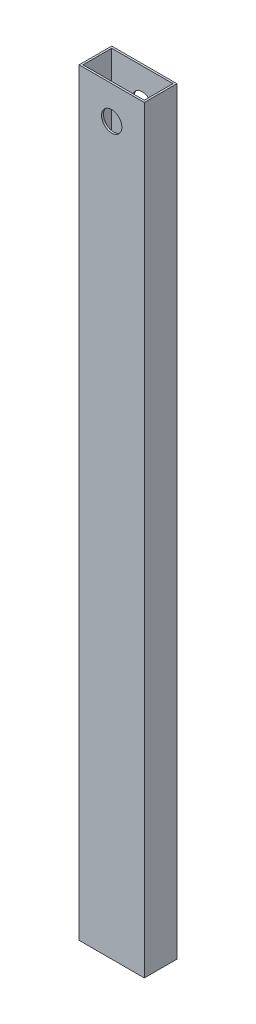
ISO-10303-21;
HEADER;
FILE_DESCRIPTION(('STEP AP214'),'2;1');
FILE_NAME('part.step','',(''),(''),'','','');
FILE_SCHEMA(('AUTOMOTIVE_DESIGN { 1 0 10303 214 1 1 1 1 }'));
ENDSEC;
DATA;
#1=APPLICATION_CONTEXT('core data for automotive mechanical design processes');
#2=APPLICATION_PROTOCOL_DEFINITION('international standard','automotive_design',2000,#1);
#3=PRODUCT_CONTEXT('',#1,'mechanical');
#4=PRODUCT('Part','Part','',(#3));
#5=PRODUCT_RELATED_PRODUCT_CATEGORY('part','',(#4));
#6=PRODUCT_DEFINITION_FORMATION('','',#4);
#7=PRODUCT_DEFINITION_CONTEXT('part definition',#1,'design');
#8=PRODUCT_DEFINITION('design','',#6,#7);
#9=PRODUCT_DEFINITION_SHAPE('','',#8);
#10=(LENGTH_UNIT() NAMED_UNIT(*) SI_UNIT(.MILLI.,.METRE.));
#11=(NAMED_UNIT(*) PLANE_ANGLE_UNIT() SI_UNIT($,.RADIAN.));
#12=(NAMED_UNIT(*) SI_UNIT($,.STERADIAN.) SOLID_ANGLE_UNIT());
#13=UNCERTAINTY_MEASURE_WITH_UNIT(LENGTH_MEASURE(1.E-05),#10,'distance_accuracy_value','');
#14=(GEOMETRIC_REPRESENTATION_CONTEXT(3) GLOBAL_UNCERTAINTY_ASSIGNED_CONTEXT((#13)) GLOBAL_UNIT_ASSIGNED_CONTEXT((#10,
#11,#12)) REPRESENTATION_CONTEXT('',''));
#15=CARTESIAN_POINT('',(0.,0.,0.));
#16=DIRECTION('',(0.,0.,1.));
#17=DIRECTION('',(1.,0.,0.));
#18=AXIS2_PLACEMENT_3D('',#15,#16,#17);
#19=CARTESIAN_POINT('',(0.,590.55,0.));
#20=DIRECTION('',(0.,1.,0.));
#21=DIRECTION('',(0.,0.,1.));
#22=AXIS2_PLACEMENT_3D('',#19,#20,#21);
#23=PLANE('',#22);
#24=DIRECTION('',(0.,0.,1.));
#25=VECTOR('',#24,1.);
#26=CARTESIAN_POINT('',(-26.2964705882353,590.55,-4.03411764705882));
#27=LINE('',#26,#25);
#28=CARTESIAN_POINT('',(-26.2964705882353,590.55,-4.03411764705882));
#29=VERTEX_POINT('',#28);
#30=CARTESIAN_POINT('',(-26.2964705882353,590.55,21.3658823529412));
#31=VERTEX_POINT('',#30);
#32=EDGE_CURVE('E156',#29,#31,#27,.T.);
#33=ORIENTED_EDGE('',*,*,#32,.T.);
#34=DIRECTION('',(1.,0.,0.));
#35=VECTOR('',#34,1.);
#36=CARTESIAN_POINT('',(-26.2964705882353,590.55,21.3658823529412));
#37=LINE('',#36,#35);
#38=CARTESIAN_POINT('',(24.5035294117647,590.55,21.3658823529412));
#39=VERTEX_POINT('',#38);
#40=EDGE_CURVE('E160',#31,#39,#37,.T.);
#41=ORIENTED_EDGE('',*,*,#40,.T.);
#42=DIRECTION('',(0.,0.,-1.));
#43=VECTOR('',#42,1.);
#44=CARTESIAN_POINT('',(24.5035294117647,590.55,-4.03411764705882));
#45=LINE('',#44,#43);
#46=CARTESIAN_POINT('',(24.5035294117647,590.55,-4.03411764705882));
#47=VERTEX_POINT('',#46);
#48=EDGE_CURVE('E164',#39,#47,#45,.T.);
#49=ORIENTED_EDGE('',*,*,#48,.T.);
#50=DIRECTION('',(-1.,0.,0.));
#51=VECTOR('',#50,1.);
#52=CARTESIAN_POINT('',(-26.2964705882353,590.55,-4.03411764705882));
#53=LINE('',#52,#51);
#54=EDGE_CURVE('E167',#47,#29,#53,.T.);
#55=ORIENTED_EDGE('',*,*,#54,.T.);
#56=EDGE_LOOP('',(#33,#41,#49,#55));
#57=FACE_BOUND('',#56,.T.);
#58=DIRECTION('',(1.,0.,0.));
#59=VECTOR('',#58,1.);
#60=CARTESIAN_POINT('',(-24.7724705882353,590.55,19.8418823529412));
#61=LINE('',#60,#59);
#62=CARTESIAN_POINT('',(-24.7724705882353,590.55,19.8418823529412));
#63=VERTEX_POINT('',#62);
#64=CARTESIAN_POINT('',(22.9795294117647,590.55,19.8418823529412));
#65=VERTEX_POINT('',#64);
#66=EDGE_CURVE('E115',#63,#65,#61,.T.);
#67=ORIENTED_EDGE('',*,*,#66,.F.);
#68=DIRECTION('',(0.,0.,1.));
#69=VECTOR('',#68,1.);
#70=CARTESIAN_POINT('',(-24.7724705882353,590.55,-2.51011764705882));
#71=LINE('',#70,#69);
#72=CARTESIAN_POINT('',(-24.7724705882353,590.55,-2.51011764705882));
#73=VERTEX_POINT('',#72);
#74=EDGE_CURVE('E106',#73,#63,#71,.T.);
#75=ORIENTED_EDGE('',*,*,#74,.F.);
#76=DIRECTION('',(-1.,0.,0.));
#77=VECTOR('',#76,1.);
#78=CARTESIAN_POINT('',(-24.7724705882353,590.55,-2.51011764705882));
#79=LINE('',#78,#77);
#80=CARTESIAN_POINT('',(22.9795294117647,590.55,-2.51011764705882));
#81=VERTEX_POINT('',#80);
#82=EDGE_CURVE('E132',#81,#73,#79,.T.);
#83=ORIENTED_EDGE('',*,*,#82,.F.);
#84=DIRECTION('',(0.,0.,-1.));
#85=VECTOR('',#84,1.);
#86=CARTESIAN_POINT('',(22.9795294117647,590.55,-2.51011764705882));
#87=LINE('',#86,#85);
#88=EDGE_CURVE('E128',#65,#81,#87,.T.);
#89=ORIENTED_EDGE('',*,*,#88,.F.);
#90=EDGE_LOOP('',(#67,#75,#83,#89));
#91=FACE_BOUND('',#90,.T.);
#92=ADVANCED_FACE('F39',(#57,#91),#23,.T.);
#93=CARTESIAN_POINT('',(0.,0.,0.));
#94=DIRECTION('',(0.,1.,0.));
#95=DIRECTION('',(0.,0.,1.));
#96=AXIS2_PLACEMENT_3D('',#93,#94,#95);
#97=PLANE('',#96);
#98=DIRECTION('',(0.,0.,1.));
#99=VECTOR('',#98,1.);
#100=CARTESIAN_POINT('',(-26.2964705882353,0.,-4.03411764705882));
#101=LINE('',#100,#99);
#102=CARTESIAN_POINT('',(-26.2964705882353,0.,-4.03411764705882));
#103=VERTEX_POINT('',#102);
#104=CARTESIAN_POINT('',(-26.2964705882353,0.,21.3658823529412));
#105=VERTEX_POINT('',#104);
#106=EDGE_CURVE('E124',#103,#105,#101,.T.);
#107=ORIENTED_EDGE('',*,*,#106,.F.);
#108=DIRECTION('',(-1.,0.,0.));
#109=VECTOR('',#108,1.);
#110=CARTESIAN_POINT('',(-26.2964705882353,0.,-4.03411764705882));
#111=LINE('',#110,#109);
#112=CARTESIAN_POINT('',(24.5035294117647,0.,-4.03411764705882));
#113=VERTEX_POINT('',#112);
#114=EDGE_CURVE('E161',#113,#103,#111,.T.);
#115=ORIENTED_EDGE('',*,*,#114,.F.);
#116=DIRECTION('',(0.,0.,-1.));
#117=VECTOR('',#116,1.);
#118=CARTESIAN_POINT('',(24.5035294117647,0.,-4.03411764705882));
#119=LINE('',#118,#117);
#120=CARTESIAN_POINT('',(24.5035294117647,0.,21.3658823529412));
#121=VERTEX_POINT('',#120);
#122=EDGE_CURVE('E177',#121,#113,#119,.T.);
#123=ORIENTED_EDGE('',*,*,#122,.F.);
#124=DIRECTION('',(1.,0.,0.));
#125=VECTOR('',#124,1.);
#126=CARTESIAN_POINT('',(-26.2964705882353,0.,21.3658823529412));
#127=LINE('',#126,#125);
#128=EDGE_CURVE('E174',#105,#121,#127,.T.);
#129=ORIENTED_EDGE('',*,*,#128,.F.);
#130=EDGE_LOOP('',(#107,#115,#123,#129));
#131=FACE_BOUND('',#130,.T.);
#132=DIRECTION('',(0.,0.,1.));
#133=VECTOR('',#132,1.);
#134=CARTESIAN_POINT('',(-24.7724705882353,0.,-2.51011764705882));
#135=LINE('',#134,#133);
#136=CARTESIAN_POINT('',(-24.7724705882353,0.,-2.51011764705882));
#137=VERTEX_POINT('',#136);
#138=CARTESIAN_POINT('',(-24.7724705882353,0.,19.8418823529412));
#139=VERTEX_POINT('',#138);
#140=EDGE_CURVE('E64',#137,#139,#135,.T.);
#141=ORIENTED_EDGE('',*,*,#140,.T.);
#142=DIRECTION('',(1.,0.,0.));
#143=VECTOR('',#142,1.);
#144=CARTESIAN_POINT('',(-24.7724705882353,0.,19.8418823529412));
#145=LINE('',#144,#143);
#146=CARTESIAN_POINT('',(22.9795294117647,0.,19.8418823529412));
#147=VERTEX_POINT('',#146);
#148=EDGE_CURVE('E122',#139,#147,#145,.T.);
#149=ORIENTED_EDGE('',*,*,#148,.T.);
#150=DIRECTION('',(0.,0.,-1.));
#151=VECTOR('',#150,1.);
#152=CARTESIAN_POINT('',(22.9795294117647,0.,-2.51011764705882));
#153=LINE('',#152,#151);
#154=CARTESIAN_POINT('',(22.9795294117647,0.,-2.51011764705882));
#155=VERTEX_POINT('',#154);
#156=EDGE_CURVE('E143',#147,#155,#153,.T.);
#157=ORIENTED_EDGE('',*,*,#156,.T.);
#158=DIRECTION('',(-1.,0.,0.));
#159=VECTOR('',#158,1.);
#160=CARTESIAN_POINT('',(-24.7724705882353,0.,-2.51011764705882));
#161=LINE('',#160,#159);
#162=EDGE_CURVE('E116',#155,#137,#161,.T.);
#163=ORIENTED_EDGE('',*,*,#162,.T.);
#164=EDGE_LOOP('',(#141,#149,#157,#163));
#165=FACE_BOUND('',#164,.T.);
#166=ADVANCED_FACE('F201',(#131,#165),#97,.F.);
#167=CARTESIAN_POINT('',(-26.2964705882353,590.55,-4.03411764705882));
#168=DIRECTION('',(1.,0.,0.));
#169=DIRECTION('',(0.,0.,-1.));
#170=AXIS2_PLACEMENT_3D('',#167,#168,#169);
#171=PLANE('',#170);
#172=ORIENTED_EDGE('',*,*,#106,.T.);
#173=DIRECTION('',(0.,-1.,0.));
#174=VECTOR('',#173,1.);
#175=CARTESIAN_POINT('',(-26.2964705882353,590.55,21.3658823529412));
#176=LINE('',#175,#174);
#177=EDGE_CURVE('E11',#31,#105,#176,.T.);
#178=ORIENTED_EDGE('',*,*,#177,.F.);
#179=ORIENTED_EDGE('',*,*,#32,.F.);
#180=DIRECTION('',(0.,-1.,0.));
#181=VECTOR('',#180,1.);
#182=CARTESIAN_POINT('',(-26.2964705882353,590.55,-4.03411764705882));
#183=LINE('',#182,#181);
#184=EDGE_CURVE('E170',#29,#103,#183,.T.);
#185=ORIENTED_EDGE('',*,*,#184,.T.);
#186=EDGE_LOOP('',(#172,#178,#179,#185));
#187=FACE_BOUND('',#186,.T.);
#188=ADVANCED_FACE('F41',(#187),#171,.F.);
#189=CARTESIAN_POINT('',(-26.2964705882353,590.55,21.3658823529412));
#190=DIRECTION('',(0.,0.,-1.));
#191=DIRECTION('',(-1.,0.,0.));
#192=AXIS2_PLACEMENT_3D('',#189,#190,#191);
#193=PLANE('',#192);
#194=CARTESIAN_POINT('',(-0.89647058823529,565.15,21.3658823529412));
#195=DIRECTION('',(0.,0.,1.));
#196=DIRECTION('',(1.,0.,0.));
#197=AXIS2_PLACEMENT_3D('',#194,#195,#196);
#198=CIRCLE('',#197,7.93750000000004);
#199=CARTESIAN_POINT('',(7.04102941176475,565.15,21.3658823529412));
#200=VERTEX_POINT('',#199);
#201=EDGE_CURVE('E239',#200,#200,#198,.T.);
#202=ORIENTED_EDGE('',*,*,#201,.F.);
#203=EDGE_LOOP('',(#202));
#204=FACE_BOUND('',#203,.T.);
#205=ORIENTED_EDGE('',*,*,#128,.T.);
#206=DIRECTION('',(0.,-1.,0.));
#207=VECTOR('',#206,1.);
#208=CARTESIAN_POINT('',(24.5035294117647,590.55,21.3658823529412));
#209=LINE('',#208,#207);
#210=EDGE_CURVE('E49',#39,#121,#209,.T.);
#211=ORIENTED_EDGE('',*,*,#210,.F.);
#212=ORIENTED_EDGE('',*,*,#40,.F.);
#213=ORIENTED_EDGE('',*,*,#177,.T.);
#214=EDGE_LOOP('',(#205,#211,#212,#213));
#215=FACE_BOUND('',#214,.T.);
#216=ADVANCED_FACE('F211',(#204,#215),#193,.F.);
#217=CARTESIAN_POINT('',(24.5035294117647,590.55,-4.03411764705882));
#218=DIRECTION('',(-1.,0.,0.));
#219=DIRECTION('',(0.,0.,1.));
#220=AXIS2_PLACEMENT_3D('',#217,#218,#219);
#221=PLANE('',#220);
#222=ORIENTED_EDGE('',*,*,#122,.T.);
#223=DIRECTION('',(0.,-1.,0.));
#224=VECTOR('',#223,1.);
#225=CARTESIAN_POINT('',(24.5035294117647,590.55,-4.03411764705882));
#226=LINE('',#225,#224);
#227=EDGE_CURVE('E185',#47,#113,#226,.T.);
#228=ORIENTED_EDGE('',*,*,#227,.F.);
#229=ORIENTED_EDGE('',*,*,#48,.F.);
#230=ORIENTED_EDGE('',*,*,#210,.T.);
#231=EDGE_LOOP('',(#222,#228,#229,#230));
#232=FACE_BOUND('',#231,.T.);
#233=ADVANCED_FACE('F195',(#232),#221,.F.);
#234=CARTESIAN_POINT('',(-26.2964705882353,590.55,-4.03411764705882));
#235=DIRECTION('',(0.,0.,1.));
#236=DIRECTION('',(1.,0.,0.));
#237=AXIS2_PLACEMENT_3D('',#234,#235,#236);
#238=PLANE('',#237);
#239=CARTESIAN_POINT('',(-0.89647058823529,565.15,-4.03411764705882));
#240=DIRECTION('',(0.,0.,1.));
#241=DIRECTION('',(1.,0.,0.));
#242=AXIS2_PLACEMENT_3D('',#239,#240,#241);
#243=CIRCLE('',#242,7.93750000000004);
#244=CARTESIAN_POINT('',(7.04102941176475,565.15,-4.03411764705882));
#245=VERTEX_POINT('',#244);
#246=EDGE_CURVE('E236',#245,#245,#243,.T.);
#247=ORIENTED_EDGE('',*,*,#246,.T.);
#248=EDGE_LOOP('',(#247));
#249=FACE_BOUND('',#248,.T.);
#250=ORIENTED_EDGE('',*,*,#114,.T.);
#251=ORIENTED_EDGE('',*,*,#184,.F.);
#252=ORIENTED_EDGE('',*,*,#54,.F.);
#253=ORIENTED_EDGE('',*,*,#227,.T.);
#254=EDGE_LOOP('',(#250,#251,#252,#253));
#255=FACE_BOUND('',#254,.T.);
#256=ADVANCED_FACE('F205',(#249,#255),#238,.F.);
#257=CARTESIAN_POINT('',(-24.7724705882353,590.55,-2.51011764705882));
#258=DIRECTION('',(1.,0.,0.));
#259=DIRECTION('',(0.,0.,-1.));
#260=AXIS2_PLACEMENT_3D('',#257,#258,#259);
#261=PLANE('',#260);
#262=ORIENTED_EDGE('',*,*,#140,.F.);
#263=DIRECTION('',(0.,-1.,0.));
#264=VECTOR('',#263,1.);
#265=CARTESIAN_POINT('',(-24.7724705882353,590.55,-2.51011764705882));
#266=LINE('',#265,#264);
#267=EDGE_CURVE('E110',#73,#137,#266,.T.);
#268=ORIENTED_EDGE('',*,*,#267,.F.);
#269=ORIENTED_EDGE('',*,*,#74,.T.);
#270=DIRECTION('',(0.,-1.,0.));
#271=VECTOR('',#270,1.);
#272=CARTESIAN_POINT('',(-24.7724705882353,590.55,19.8418823529412));
#273=LINE('',#272,#271);
#274=EDGE_CURVE('E109',#63,#139,#273,.T.);
#275=ORIENTED_EDGE('',*,*,#274,.T.);
#276=EDGE_LOOP('',(#262,#268,#269,#275));
#277=FACE_BOUND('',#276,.T.);
#278=ADVANCED_FACE('F108',(#277),#261,.T.);
#279=CARTESIAN_POINT('',(-24.7724705882353,590.55,19.8418823529412));
#280=DIRECTION('',(0.,0.,-1.));
#281=DIRECTION('',(-1.,0.,0.));
#282=AXIS2_PLACEMENT_3D('',#279,#280,#281);
#283=PLANE('',#282);
#284=CARTESIAN_POINT('',(-0.89647058823529,565.15,19.8418823529412));
#285=DIRECTION('',(0.,0.,-1.));
#286=DIRECTION('',(-1.,0.,0.));
#287=AXIS2_PLACEMENT_3D('',#284,#285,#286);
#288=CIRCLE('',#287,7.93750000000004);
#289=CARTESIAN_POINT('',(-8.83397058823533,565.15,19.8418823529412));
#290=VERTEX_POINT('',#289);
#291=EDGE_CURVE('E140',#290,#290,#288,.T.);
#292=ORIENTED_EDGE('',*,*,#291,.F.);
#293=EDGE_LOOP('',(#292));
#294=FACE_BOUND('',#293,.T.);
#295=ORIENTED_EDGE('',*,*,#148,.F.);
#296=ORIENTED_EDGE('',*,*,#274,.F.);
#297=ORIENTED_EDGE('',*,*,#66,.T.);
#298=DIRECTION('',(0.,-1.,0.));
#299=VECTOR('',#298,1.);
#300=CARTESIAN_POINT('',(22.9795294117647,590.55,19.8418823529412));
#301=LINE('',#300,#299);
#302=EDGE_CURVE('E125',#65,#147,#301,.T.);
#303=ORIENTED_EDGE('',*,*,#302,.T.);
#304=EDGE_LOOP('',(#295,#296,#297,#303));
#305=FACE_BOUND('',#304,.T.);
#306=ADVANCED_FACE('F119',(#294,#305),#283,.T.);
#307=CARTESIAN_POINT('',(22.9795294117647,590.55,-2.51011764705882));
#308=DIRECTION('',(-1.,0.,0.));
#309=DIRECTION('',(0.,0.,1.));
#310=AXIS2_PLACEMENT_3D('',#307,#308,#309);
#311=PLANE('',#310);
#312=ORIENTED_EDGE('',*,*,#156,.F.);
#313=ORIENTED_EDGE('',*,*,#302,.F.);
#314=ORIENTED_EDGE('',*,*,#88,.T.);
#315=DIRECTION('',(0.,-1.,0.));
#316=VECTOR('',#315,1.);
#317=CARTESIAN_POINT('',(22.9795294117647,590.55,-2.51011764705882));
#318=LINE('',#317,#316);
#319=EDGE_CURVE('E56',#81,#155,#318,.T.);
#320=ORIENTED_EDGE('',*,*,#319,.T.);
#321=EDGE_LOOP('',(#312,#313,#314,#320));
#322=FACE_BOUND('',#321,.T.);
#323=ADVANCED_FACE('F254',(#322),#311,.T.);
#324=CARTESIAN_POINT('',(-24.7724705882353,590.55,-2.51011764705882));
#325=DIRECTION('',(0.,0.,1.));
#326=DIRECTION('',(1.,0.,0.));
#327=AXIS2_PLACEMENT_3D('',#324,#325,#326);
#328=PLANE('',#327);
#329=CARTESIAN_POINT('',(-0.89647058823529,565.15,-2.51011764705882));
#330=DIRECTION('',(0.,0.,1.));
#331=DIRECTION('',(1.,0.,0.));
#332=AXIS2_PLACEMENT_3D('',#329,#330,#331);
#333=CIRCLE('',#332,7.93750000000004);
#334=CARTESIAN_POINT('',(7.04102941176475,565.15,-2.51011764705882));
#335=VERTEX_POINT('',#334);
#336=EDGE_CURVE('E43',#335,#335,#333,.T.);
#337=ORIENTED_EDGE('',*,*,#336,.F.);
#338=EDGE_LOOP('',(#337));
#339=FACE_BOUND('',#338,.T.);
#340=ORIENTED_EDGE('',*,*,#162,.F.);
#341=ORIENTED_EDGE('',*,*,#319,.F.);
#342=ORIENTED_EDGE('',*,*,#82,.T.);
#343=ORIENTED_EDGE('',*,*,#267,.T.);
#344=EDGE_LOOP('',(#340,#341,#342,#343));
#345=FACE_BOUND('',#344,.T.);
#346=ADVANCED_FACE('F258',(#339,#345),#328,.T.);
#347=CARTESIAN_POINT('',(-0.89647058823529,565.15,-4.03411764705882));
#348=DIRECTION('',(0.,0.,1.));
#349=DIRECTION('',(1.,0.,0.));
#350=AXIS2_PLACEMENT_3D('',#347,#348,#349);
#351=CYLINDRICAL_SURFACE('',#350,7.93750000000004);
#352=ORIENTED_EDGE('',*,*,#336,.T.);
#353=EDGE_LOOP('',(#352));
#354=FACE_BOUND('',#353,.T.);
#355=ORIENTED_EDGE('',*,*,#246,.F.);
#356=EDGE_LOOP('',(#355));
#357=FACE_BOUND('',#356,.T.);
#358=ADVANCED_FACE('F264',(#354,#357),#351,.F.);
#359=ORIENTED_EDGE('',*,*,#291,.T.);
#360=EDGE_LOOP('',(#359));
#361=FACE_BOUND('',#360,.T.);
#362=ORIENTED_EDGE('',*,*,#201,.T.);
#363=EDGE_LOOP('',(#362));
#364=FACE_BOUND('',#363,.T.);
#365=ADVANCED_FACE('F250',(#361,#364),#351,.F.);
#366=CLOSED_SHELL('',(#92,#166,#188,#216,#233,#256,#278,#306,#323,#346,#358,#365));
#367=MANIFOLD_SOLID_BREP('B2',#366);
#368=ADVANCED_BREP_SHAPE_REPRESENTATION('',(#18,#367),#14);
#369=SHAPE_DEFINITION_REPRESENTATION(#9,#368);
ENDSEC;
END-ISO-10303-21;
